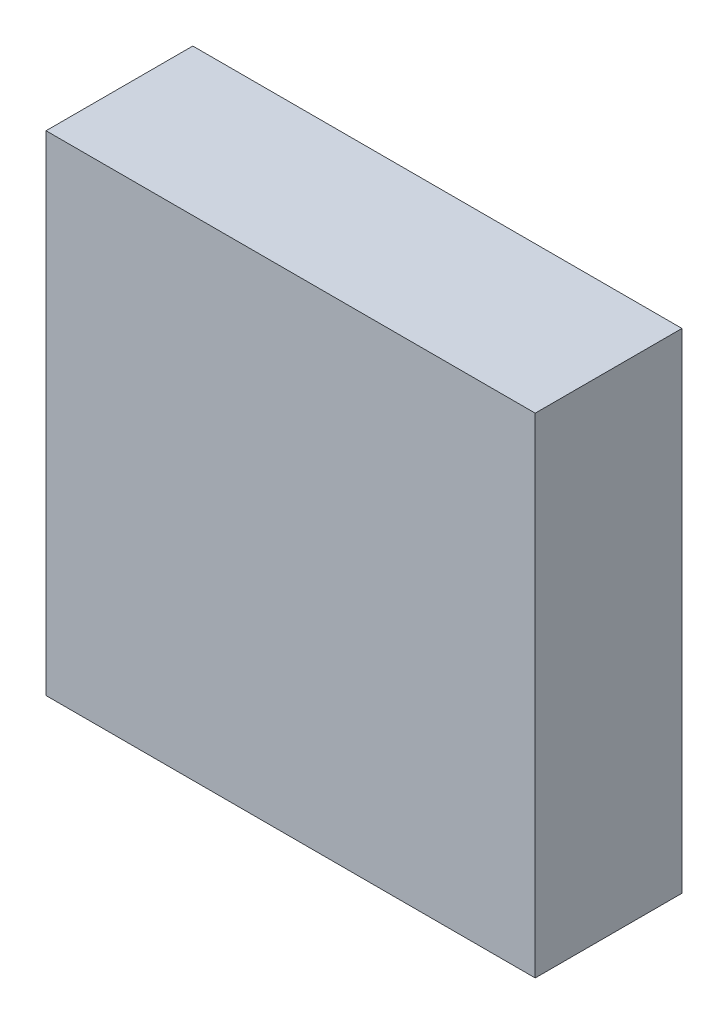
ISO-10303-21;
HEADER;
FILE_DESCRIPTION(('STEP AP214'),'2;1');
FILE_NAME('part.step','',(''),(''),'','','');
FILE_SCHEMA(('AUTOMOTIVE_DESIGN { 1 0 10303 214 1 1 1 1 }'));
ENDSEC;
DATA;
#1=APPLICATION_CONTEXT('core data for automotive mechanical design processes');
#2=APPLICATION_PROTOCOL_DEFINITION('international standard','automotive_design',2000,#1);
#3=PRODUCT_CONTEXT('',#1,'mechanical');
#4=PRODUCT('Part','Part','',(#3));
#5=PRODUCT_RELATED_PRODUCT_CATEGORY('part','',(#4));
#6=PRODUCT_DEFINITION_FORMATION('','',#4);
#7=PRODUCT_DEFINITION_CONTEXT('part definition',#1,'design');
#8=PRODUCT_DEFINITION('design','',#6,#7);
#9=PRODUCT_DEFINITION_SHAPE('','',#8);
#10=(LENGTH_UNIT() NAMED_UNIT(*) SI_UNIT(.MILLI.,.METRE.));
#11=(NAMED_UNIT(*) PLANE_ANGLE_UNIT() SI_UNIT($,.RADIAN.));
#12=(NAMED_UNIT(*) SI_UNIT($,.STERADIAN.) SOLID_ANGLE_UNIT());
#13=UNCERTAINTY_MEASURE_WITH_UNIT(LENGTH_MEASURE(1.E-05),#10,'distance_accuracy_value','');
#14=(GEOMETRIC_REPRESENTATION_CONTEXT(3) GLOBAL_UNCERTAINTY_ASSIGNED_CONTEXT((#13)) GLOBAL_UNIT_ASSIGNED_CONTEXT((#10,
#11,#12)) REPRESENTATION_CONTEXT('',''));
#15=CARTESIAN_POINT('',(0.,0.,0.));
#16=DIRECTION('',(0.,0.,1.));
#17=DIRECTION('',(1.,0.,0.));
#18=AXIS2_PLACEMENT_3D('',#15,#16,#17);
#19=CARTESIAN_POINT('',(0.,0.,9.6));
#20=DIRECTION('',(0.,1.,0.));
#21=DIRECTION('',(0.,0.,1.));
#22=AXIS2_PLACEMENT_3D('',#19,#20,#21);
#23=PLANE('',#22);
#24=DIRECTION('',(1.,0.,0.));
#25=VECTOR('',#24,1.);
#26=CARTESIAN_POINT('',(0.,0.,0.));
#27=LINE('',#26,#25);
#28=CARTESIAN_POINT('',(-32.,0.,0.));
#29=VERTEX_POINT('',#28);
#30=CARTESIAN_POINT('',(0.,0.,0.));
#31=VERTEX_POINT('',#30);
#32=EDGE_CURVE('E113',#29,#31,#27,.T.);
#33=ORIENTED_EDGE('',*,*,#32,.T.);
#34=DIRECTION('',(0.,0.,-1.));
#35=VECTOR('',#34,1.);
#36=CARTESIAN_POINT('',(0.,0.,9.6));
#37=LINE('',#36,#35);
#38=CARTESIAN_POINT('',(0.,0.,9.6));
#39=VERTEX_POINT('',#38);
#40=EDGE_CURVE('E11',#39,#31,#37,.T.);
#41=ORIENTED_EDGE('',*,*,#40,.F.);
#42=DIRECTION('',(1.,0.,0.));
#43=VECTOR('',#42,1.);
#44=CARTESIAN_POINT('',(0.,0.,9.6));
#45=LINE('',#44,#43);
#46=CARTESIAN_POINT('',(-32.,0.,9.6));
#47=VERTEX_POINT('',#46);
#48=EDGE_CURVE('E97',#47,#39,#45,.T.);
#49=ORIENTED_EDGE('',*,*,#48,.F.);
#50=DIRECTION('',(0.,0.,-1.));
#51=VECTOR('',#50,1.);
#52=CARTESIAN_POINT('',(-32.,0.,9.6));
#53=LINE('',#52,#51);
#54=EDGE_CURVE('E109',#47,#29,#53,.T.);
#55=ORIENTED_EDGE('',*,*,#54,.T.);
#56=EDGE_LOOP('',(#33,#41,#49,#55));
#57=FACE_BOUND('',#56,.T.);
#58=ADVANCED_FACE('F45',(#57),#23,.F.);
#59=CARTESIAN_POINT('',(0.,0.,9.6));
#60=DIRECTION('',(-1.,0.,0.));
#61=DIRECTION('',(0.,0.,1.));
#62=AXIS2_PLACEMENT_3D('',#59,#60,#61);
#63=PLANE('',#62);
#64=DIRECTION('',(0.,1.,0.));
#65=VECTOR('',#64,1.);
#66=CARTESIAN_POINT('',(0.,0.,0.));
#67=LINE('',#66,#65);
#68=CARTESIAN_POINT('',(0.,32.,0.));
#69=VERTEX_POINT('',#68);
#70=EDGE_CURVE('E102',#31,#69,#67,.T.);
#71=ORIENTED_EDGE('',*,*,#70,.T.);
#72=DIRECTION('',(0.,0.,-1.));
#73=VECTOR('',#72,1.);
#74=CARTESIAN_POINT('',(0.,32.,9.6));
#75=LINE('',#74,#73);
#76=CARTESIAN_POINT('',(0.,32.,9.6));
#77=VERTEX_POINT('',#76);
#78=EDGE_CURVE('E54',#77,#69,#75,.T.);
#79=ORIENTED_EDGE('',*,*,#78,.F.);
#80=DIRECTION('',(0.,1.,0.));
#81=VECTOR('',#80,1.);
#82=CARTESIAN_POINT('',(0.,0.,9.6));
#83=LINE('',#82,#81);
#84=EDGE_CURVE('E92',#39,#77,#83,.T.);
#85=ORIENTED_EDGE('',*,*,#84,.F.);
#86=ORIENTED_EDGE('',*,*,#40,.T.);
#87=EDGE_LOOP('',(#71,#79,#85,#86));
#88=FACE_BOUND('',#87,.T.);
#89=ADVANCED_FACE('F101',(#88),#63,.F.);
#90=CARTESIAN_POINT('',(0.,32.,9.6));
#91=DIRECTION('',(0.,-1.,0.));
#92=DIRECTION('',(0.,0.,-1.));
#93=AXIS2_PLACEMENT_3D('',#90,#91,#92);
#94=PLANE('',#93);
#95=DIRECTION('',(-1.,0.,0.));
#96=VECTOR('',#95,1.);
#97=CARTESIAN_POINT('',(0.,32.,0.));
#98=LINE('',#97,#96);
#99=CARTESIAN_POINT('',(-32.,32.,0.));
#100=VERTEX_POINT('',#99);
#101=EDGE_CURVE('E79',#69,#100,#98,.T.);
#102=ORIENTED_EDGE('',*,*,#101,.T.);
#103=DIRECTION('',(0.,0.,-1.));
#104=VECTOR('',#103,1.);
#105=CARTESIAN_POINT('',(-32.,32.,9.6));
#106=LINE('',#105,#104);
#107=CARTESIAN_POINT('',(-32.,32.,9.6));
#108=VERTEX_POINT('',#107);
#109=EDGE_CURVE('E104',#108,#100,#106,.T.);
#110=ORIENTED_EDGE('',*,*,#109,.F.);
#111=DIRECTION('',(-1.,0.,0.));
#112=VECTOR('',#111,1.);
#113=CARTESIAN_POINT('',(0.,32.,9.6));
#114=LINE('',#113,#112);
#115=EDGE_CURVE('E95',#77,#108,#114,.T.);
#116=ORIENTED_EDGE('',*,*,#115,.F.);
#117=ORIENTED_EDGE('',*,*,#78,.T.);
#118=EDGE_LOOP('',(#102,#110,#116,#117));
#119=FACE_BOUND('',#118,.T.);
#120=ADVANCED_FACE('F105',(#119),#94,.F.);
#121=CARTESIAN_POINT('',(-32.,0.,9.6));
#122=DIRECTION('',(1.,0.,0.));
#123=DIRECTION('',(0.,0.,-1.));
#124=AXIS2_PLACEMENT_3D('',#121,#122,#123);
#125=PLANE('',#124);
#126=DIRECTION('',(0.,-1.,0.));
#127=VECTOR('',#126,1.);
#128=CARTESIAN_POINT('',(-32.,0.,0.));
#129=LINE('',#128,#127);
#130=EDGE_CURVE('E85',#100,#29,#129,.T.);
#131=ORIENTED_EDGE('',*,*,#130,.T.);
#132=ORIENTED_EDGE('',*,*,#54,.F.);
#133=DIRECTION('',(0.,-1.,0.));
#134=VECTOR('',#133,1.);
#135=CARTESIAN_POINT('',(-32.,0.,9.6));
#136=LINE('',#135,#134);
#137=EDGE_CURVE('E62',#108,#47,#136,.T.);
#138=ORIENTED_EDGE('',*,*,#137,.F.);
#139=ORIENTED_EDGE('',*,*,#109,.T.);
#140=EDGE_LOOP('',(#131,#132,#138,#139));
#141=FACE_BOUND('',#140,.T.);
#142=ADVANCED_FACE('F126',(#141),#125,.F.);
#143=CARTESIAN_POINT('',(0.,0.,9.6));
#144=DIRECTION('',(0.,0.,-1.));
#145=DIRECTION('',(-1.,0.,0.));
#146=AXIS2_PLACEMENT_3D('',#143,#144,#145);
#147=PLANE('',#146);
#148=ORIENTED_EDGE('',*,*,#48,.T.);
#149=ORIENTED_EDGE('',*,*,#84,.T.);
#150=ORIENTED_EDGE('',*,*,#115,.T.);
#151=ORIENTED_EDGE('',*,*,#137,.T.);
#152=EDGE_LOOP('',(#148,#149,#150,#151));
#153=FACE_BOUND('',#152,.T.);
#154=ADVANCED_FACE('F93',(#153),#147,.F.);
#155=CARTESIAN_POINT('',(0.,0.,0.));
#156=DIRECTION('',(0.,0.,-1.));
#157=DIRECTION('',(-1.,0.,0.));
#158=AXIS2_PLACEMENT_3D('',#155,#156,#157);
#159=PLANE('',#158);
#160=ORIENTED_EDGE('',*,*,#32,.F.);
#161=ORIENTED_EDGE('',*,*,#130,.F.);
#162=ORIENTED_EDGE('',*,*,#101,.F.);
#163=ORIENTED_EDGE('',*,*,#70,.F.);
#164=EDGE_LOOP('',(#160,#161,#162,#163));
#165=FACE_BOUND('',#164,.T.);
#166=ADVANCED_FACE('F129',(#165),#159,.T.);
#167=CLOSED_SHELL('',(#58,#89,#120,#142,#154,#166));
#168=MANIFOLD_SOLID_BREP('B2',#167);
#169=ADVANCED_BREP_SHAPE_REPRESENTATION('',(#18,#168),#14);
#170=SHAPE_DEFINITION_REPRESENTATION(#9,#169);
ENDSEC;
END-ISO-10303-21;
